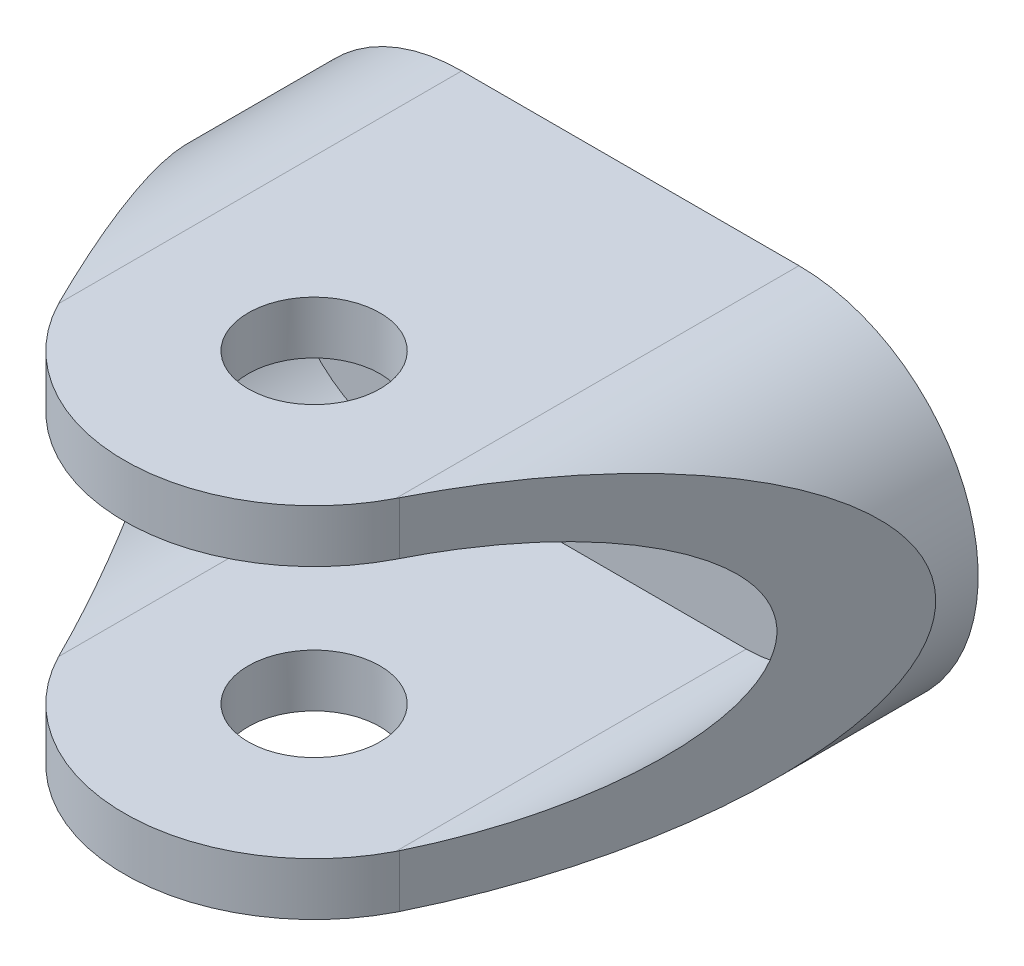
ISO-10303-21;
HEADER;
FILE_DESCRIPTION(('STEP AP214'),'2;1');
FILE_NAME('part.step','',(''),(''),'','','');
FILE_SCHEMA(('AUTOMOTIVE_DESIGN { 1 0 10303 214 1 1 1 1 }'));
ENDSEC;
DATA;
#1=APPLICATION_CONTEXT('core data for automotive mechanical design processes');
#2=APPLICATION_PROTOCOL_DEFINITION('international standard','automotive_design',2000,#1);
#3=PRODUCT_CONTEXT('',#1,'mechanical');
#4=PRODUCT('Part','Part','',(#3));
#5=PRODUCT_RELATED_PRODUCT_CATEGORY('part','',(#4));
#6=PRODUCT_DEFINITION_FORMATION('','',#4);
#7=PRODUCT_DEFINITION_CONTEXT('part definition',#1,'design');
#8=PRODUCT_DEFINITION('design','',#6,#7);
#9=PRODUCT_DEFINITION_SHAPE('','',#8);
#10=(LENGTH_UNIT() NAMED_UNIT(*) SI_UNIT(.MILLI.,.METRE.));
#11=(NAMED_UNIT(*) PLANE_ANGLE_UNIT() SI_UNIT($,.RADIAN.));
#12=(NAMED_UNIT(*) SI_UNIT($,.STERADIAN.) SOLID_ANGLE_UNIT());
#13=UNCERTAINTY_MEASURE_WITH_UNIT(LENGTH_MEASURE(1.E-05),#10,'distance_accuracy_value','');
#14=(GEOMETRIC_REPRESENTATION_CONTEXT(3) GLOBAL_UNCERTAINTY_ASSIGNED_CONTEXT((#13)) GLOBAL_UNIT_ASSIGNED_CONTEXT((#10,
#11,#12)) REPRESENTATION_CONTEXT('',''));
#15=CARTESIAN_POINT('',(0.,0.,0.));
#16=DIRECTION('',(0.,0.,1.));
#17=DIRECTION('',(1.,0.,0.));
#18=AXIS2_PLACEMENT_3D('',#15,#16,#17);
#19=CARTESIAN_POINT('',(0.,21.59,0.));
#20=DIRECTION('',(0.,-1.,0.));
#21=DIRECTION('',(0.,0.,-1.));
#22=AXIS2_PLACEMENT_3D('',#19,#20,#21);
#23=PLANE('',#22);
#24=CARTESIAN_POINT('',(0.,21.59,3.175));
#25=DIRECTION('',(0.,1.,0.));
#26=DIRECTION('',(0.,0.,1.));
#27=AXIS2_PLACEMENT_3D('',#24,#25,#26);
#28=CIRCLE('',#27,3.96875);
#29=CARTESIAN_POINT('',(0.,21.59,7.14375));
#30=VERTEX_POINT('',#29);
#31=EDGE_CURVE('E324',#30,#30,#28,.T.);
#32=ORIENTED_EDGE('',*,*,#31,.F.);
#33=EDGE_LOOP('',(#32));
#34=FACE_BOUND('',#33,.T.);
#35=DIRECTION('',(0.,0.,1.));
#36=VECTOR('',#35,1.);
#37=CARTESIAN_POINT('',(10.16,21.59,-15.875));
#38=LINE('',#37,#36);
#39=CARTESIAN_POINT('',(10.16,21.59,-15.875));
#40=VERTEX_POINT('',#39);
#41=CARTESIAN_POINT('',(10.16,21.59,8.41134414453441));
#42=VERTEX_POINT('',#41);
#43=EDGE_CURVE('E169',#40,#42,#38,.T.);
#44=ORIENTED_EDGE('',*,*,#43,.F.);
#45=DIRECTION('',(-1.,0.,0.));
#46=VECTOR('',#45,1.);
#47=CARTESIAN_POINT('',(-22.225,21.59,-15.875));
#48=LINE('',#47,#46);
#49=CARTESIAN_POINT('',(-10.16,21.59,-15.875));
#50=VERTEX_POINT('',#49);
#51=EDGE_CURVE('E176',#40,#50,#48,.T.);
#52=ORIENTED_EDGE('',*,*,#51,.T.);
#53=DIRECTION('',(0.,0.,1.));
#54=VECTOR('',#53,1.);
#55=CARTESIAN_POINT('',(-10.16,21.59,-15.875));
#56=LINE('',#55,#54);
#57=CARTESIAN_POINT('',(-10.16,21.59,8.41134414453441));
#58=VERTEX_POINT('',#57);
#59=EDGE_CURVE('E373',#50,#58,#56,.T.);
#60=ORIENTED_EDGE('',*,*,#59,.T.);
#61=CARTESIAN_POINT('',(0.,21.59,3.175));
#62=DIRECTION('',(0.,1.,0.));
#63=DIRECTION('',(0.,0.,1.));
#64=AXIS2_PLACEMENT_3D('',#61,#62,#63);
#65=CIRCLE('',#64,11.43);
#66=EDGE_CURVE('E329',#42,#58,#65,.F.);
#67=ORIENTED_EDGE('',*,*,#66,.F.);
#68=EDGE_LOOP('',(#44,#52,#60,#67));
#69=FACE_BOUND('',#68,.T.);
#70=ADVANCED_FACE('F70',(#34,#69),#23,.F.);
#71=CARTESIAN_POINT('',(0.,0.,0.));
#72=DIRECTION('',(0.,-1.,0.));
#73=DIRECTION('',(0.,0.,-1.));
#74=AXIS2_PLACEMENT_3D('',#71,#72,#73);
#75=PLANE('',#74);
#76=CARTESIAN_POINT('',(0.,0.,3.175));
#77=DIRECTION('',(0.,1.,0.));
#78=DIRECTION('',(0.,0.,1.));
#79=AXIS2_PLACEMENT_3D('',#76,#77,#78);
#80=CIRCLE('',#79,3.96875);
#81=CARTESIAN_POINT('',(0.,0.,7.14375));
#82=VERTEX_POINT('',#81);
#83=EDGE_CURVE('E325',#82,#82,#80,.T.);
#84=ORIENTED_EDGE('',*,*,#83,.T.);
#85=EDGE_LOOP('',(#84));
#86=FACE_BOUND('',#85,.T.);
#87=DIRECTION('',(-1.,0.,0.));
#88=VECTOR('',#87,1.);
#89=CARTESIAN_POINT('',(-22.225,0.,-15.875));
#90=LINE('',#89,#88);
#91=CARTESIAN_POINT('',(10.16,0.,-15.875));
#92=VERTEX_POINT('',#91);
#93=CARTESIAN_POINT('',(-10.16,0.,-15.875));
#94=VERTEX_POINT('',#93);
#95=EDGE_CURVE('E174',#92,#94,#90,.T.);
#96=ORIENTED_EDGE('',*,*,#95,.F.);
#97=DIRECTION('',(0.,0.,1.));
#98=VECTOR('',#97,1.);
#99=CARTESIAN_POINT('',(10.16,0.,-15.875));
#100=LINE('',#99,#98);
#101=CARTESIAN_POINT('',(10.16,0.,8.41134414453441));
#102=VERTEX_POINT('',#101);
#103=EDGE_CURVE('E158',#92,#102,#100,.T.);
#104=ORIENTED_EDGE('',*,*,#103,.T.);
#105=CARTESIAN_POINT('',(0.,0.,3.175));
#106=DIRECTION('',(0.,1.,0.));
#107=DIRECTION('',(0.,0.,1.));
#108=AXIS2_PLACEMENT_3D('',#105,#106,#107);
#109=CIRCLE('',#108,11.43);
#110=CARTESIAN_POINT('',(-10.16,0.,8.41134414453441));
#111=VERTEX_POINT('',#110);
#112=EDGE_CURVE('E333',#102,#111,#109,.F.);
#113=ORIENTED_EDGE('',*,*,#112,.T.);
#114=DIRECTION('',(0.,0.,1.));
#115=VECTOR('',#114,1.);
#116=CARTESIAN_POINT('',(-10.16,0.,-15.875));
#117=LINE('',#116,#115);
#118=EDGE_CURVE('E182',#94,#111,#117,.T.);
#119=ORIENTED_EDGE('',*,*,#118,.F.);
#120=EDGE_LOOP('',(#96,#104,#113,#119));
#121=FACE_BOUND('',#120,.T.);
#122=ADVANCED_FACE('F181',(#86,#121),#75,.T.);
#123=CARTESIAN_POINT('',(0.,0.,3.175));
#124=DIRECTION('',(0.,1.,0.));
#125=DIRECTION('',(0.,0.,1.));
#126=AXIS2_PLACEMENT_3D('',#123,#124,#125);
#127=CYLINDRICAL_SURFACE('',#126,11.43);
#128=CARTESIAN_POINT('',(10.16,21.59,8.41134414453441));
#129=CARTESIAN_POINT('',(10.1729685114421,21.589999331326,8.38618152880856));
#130=CARTESIAN_POINT('',(10.1858431777622,21.589976298779,8.36097146571114));
#131=CARTESIAN_POINT('',(10.2114048201584,21.5898855059389,8.31045644477312));
#132=CARTESIAN_POINT('',(10.2240917962346,21.5898177456459,8.28515148693252));
#133=CARTESIAN_POINT('',(10.2366849271889,21.5897276214799,8.25979908172035));
#134=B_SPLINE_CURVE_WITH_KNOTS('',3,(#128,#129,#130,#131,#132,#133),.UNSPECIFIED.,.F.,.F.,(4,2,
4),(0.,0.0849219853898405,0.169843970779766),.UNSPECIFIED.);
#135=CARTESIAN_POINT('',(10.2366849271889,21.5897276214799,8.25979908172035));
#136=VERTEX_POINT('',#135);
#137=EDGE_CURVE('E86',#42,#136,#134,.T.);
#138=ORIENTED_EDGE('',*,*,#137,.F.);
#139=ORIENTED_EDGE('',*,*,#66,.T.);
#140=CARTESIAN_POINT('',(-10.16,21.59,8.41134414453441));
#141=CARTESIAN_POINT('',(-10.1729685114421,21.589999331326,8.38618152880856));
#142=CARTESIAN_POINT('',(-10.1858431777622,21.589976298779,8.36097146571114));
#143=CARTESIAN_POINT('',(-10.2114048201584,21.5898855059389,8.31045644477312));
#144=CARTESIAN_POINT('',(-10.2240917962346,21.5898177456459,8.28515148693252));
#145=CARTESIAN_POINT('',(-10.2366849271889,21.5897276214799,8.25979908172035));
#146=B_SPLINE_CURVE_WITH_KNOTS('',3,(#140,#141,#142,#143,#144,#145),.UNSPECIFIED.,.F.,.F.,(4,2,
4),(0.,0.084921985389839,0.169843970779764),.UNSPECIFIED.);
#147=CARTESIAN_POINT('',(-10.2366849271889,21.5897276214799,8.25979908172035));
#148=VERTEX_POINT('',#147);
#149=EDGE_CURVE('E276',#58,#148,#146,.T.);
#150=ORIENTED_EDGE('',*,*,#149,.T.);
#151=DIRECTION('',(0.,1.,0.));
#152=VECTOR('',#151,1.);
#153=CARTESIAN_POINT('',(-10.2366849271889,0.,8.25979908172035));
#154=LINE('',#153,#152);
#155=CARTESIAN_POINT('',(-10.2366849271889,18.4146141255277,8.25979908172035));
#156=VERTEX_POINT('',#155);
#157=EDGE_CURVE('E190',#156,#148,#154,.T.);
#158=ORIENTED_EDGE('',*,*,#157,.F.);
#159=CARTESIAN_POINT('',(-10.2366849271889,18.4146141255277,8.25979908172035));
#160=CARTESIAN_POINT('',(-10.2240918288484,18.414741803505,8.28515142248112));
#161=CARTESIAN_POINT('',(-10.2114048690791,18.4148377986997,8.31045634809602));
#162=CARTESIAN_POINT('',(-10.1858432266828,18.4149664235238,8.36097136903404));
#163=CARTESIAN_POINT('',(-10.1729685440558,18.4149990531532,8.38618146435716));
#164=CARTESIAN_POINT('',(-10.16,18.415,8.41134414453441));
#165=B_SPLINE_CURVE_WITH_KNOTS('',3,(#159,#160,#161,#162,#163,#164),.UNSPECIFIED.,.F.,.F.,(4,2,
4),(0.,0.0849221220458776,0.169844244091586),.UNSPECIFIED.);
#166=CARTESIAN_POINT('',(-10.16,18.415,8.41134414453441));
#167=VERTEX_POINT('',#166);
#168=EDGE_CURVE('E214',#156,#167,#165,.T.);
#169=ORIENTED_EDGE('',*,*,#168,.T.);
#170=CARTESIAN_POINT('',(0.,18.415,3.175));
#171=DIRECTION('',(0.,-1.,0.));
#172=DIRECTION('',(0.,0.,-1.));
#173=AXIS2_PLACEMENT_3D('',#170,#171,#172);
#174=CIRCLE('',#173,11.43);
#175=CARTESIAN_POINT('',(10.16,18.415,8.41134414453441));
#176=VERTEX_POINT('',#175);
#177=EDGE_CURVE('E204',#176,#167,#174,.T.);
#178=ORIENTED_EDGE('',*,*,#177,.F.);
#179=CARTESIAN_POINT('',(10.2366849271889,18.4146141255277,8.25979908172035));
#180=CARTESIAN_POINT('',(10.2240918288484,18.414741803505,8.28515142248112));
#181=CARTESIAN_POINT('',(10.211404869079,18.4148377986997,8.31045634809602));
#182=CARTESIAN_POINT('',(10.1858432266828,18.4149664235238,8.36097136903404));
#183=CARTESIAN_POINT('',(10.1729685440558,18.4149990531532,8.38618146435716));
#184=CARTESIAN_POINT('',(10.16,18.415,8.41134414453441));
#185=B_SPLINE_CURVE_WITH_KNOTS('',3,(#179,#180,#181,#182,#183,#184),.UNSPECIFIED.,.F.,.F.,(4,2,
4),(0.,0.0849221220458784,0.169844244091583),.UNSPECIFIED.);
#186=CARTESIAN_POINT('',(10.2366849271889,18.4146141255277,8.25979908172035));
#187=VERTEX_POINT('',#186);
#188=EDGE_CURVE('E235',#187,#176,#185,.T.);
#189=ORIENTED_EDGE('',*,*,#188,.F.);
#190=DIRECTION('',(0.,1.,0.));
#191=VECTOR('',#190,1.);
#192=CARTESIAN_POINT('',(10.2366849271889,0.,8.25979908172035));
#193=LINE('',#192,#191);
#194=EDGE_CURVE('E336',#187,#136,#193,.T.);
#195=ORIENTED_EDGE('',*,*,#194,.T.);
#196=EDGE_LOOP('',(#138,#139,#150,#158,#169,#178,#189,#195));
#197=FACE_BOUND('',#196,.T.);
#198=ADVANCED_FACE('F221',(#197),#127,.T.);
#199=CARTESIAN_POINT('',(10.2366849271889,0.000272378520056391,8.25979908172035));
#200=CARTESIAN_POINT('',(10.2240917962346,0.000182254354057978,8.28515148693252));
#201=CARTESIAN_POINT('',(10.2114048201584,0.00011449406105406,8.31045644477312));
#202=CARTESIAN_POINT('',(10.1858431777622,2.37012210352571E-05,8.36097146571114));
#203=CARTESIAN_POINT('',(10.1729685114421,6.68674020328084E-07,8.38618152880857));
#204=CARTESIAN_POINT('',(10.16,0.,8.41134414453441));
#205=B_SPLINE_CURVE_WITH_KNOTS('',3,(#199,#200,#201,#202,#203,#204),.UNSPECIFIED.,.F.,.F.,(4,2,
4),(0.,0.0849219853899263,0.169843970779768),.UNSPECIFIED.);
#206=CARTESIAN_POINT('',(10.2366849271889,0.000272378520051186,8.25979908172035));
#207=VERTEX_POINT('',#206);
#208=EDGE_CURVE('E164',#207,#102,#205,.T.);
#209=ORIENTED_EDGE('',*,*,#208,.F.);
#210=CARTESIAN_POINT('',(10.2366849271889,3.17538587447225,8.25979908172035));
#211=VERTEX_POINT('',#210);
#212=EDGE_CURVE('E338',#207,#211,#193,.T.);
#213=ORIENTED_EDGE('',*,*,#212,.T.);
#214=CARTESIAN_POINT('',(10.16,3.175,8.41134414453441));
#215=CARTESIAN_POINT('',(10.1729685440558,3.17500094684679,8.38618146435716));
#216=CARTESIAN_POINT('',(10.1858432266828,3.17503357647621,8.36097136903405));
#217=CARTESIAN_POINT('',(10.2114048690791,3.17516220130029,8.31045634809602));
#218=CARTESIAN_POINT('',(10.2240918288484,3.17525819649496,8.28515142248112));
#219=CARTESIAN_POINT('',(10.2366849271889,3.17538587447225,8.25979908172035));
#220=B_SPLINE_CURVE_WITH_KNOTS('',3,(#214,#215,#216,#217,#218,#219),.UNSPECIFIED.,.F.,.F.,(4,2,
4),(0.,0.084922122045708,0.169844244091587),.UNSPECIFIED.);
#221=CARTESIAN_POINT('',(10.16,3.175,8.41134414453441));
#222=VERTEX_POINT('',#221);
#223=EDGE_CURVE('E188',#222,#211,#220,.T.);
#224=ORIENTED_EDGE('',*,*,#223,.F.);
#225=CARTESIAN_POINT('',(0.,3.175,3.175));
#226=DIRECTION('',(0.,-1.,0.));
#227=DIRECTION('',(0.,0.,-1.));
#228=AXIS2_PLACEMENT_3D('',#225,#226,#227);
#229=CIRCLE('',#228,11.43);
#230=CARTESIAN_POINT('',(-10.16,3.175,8.41134414453441));
#231=VERTEX_POINT('',#230);
#232=EDGE_CURVE('E198',#222,#231,#229,.T.);
#233=ORIENTED_EDGE('',*,*,#232,.T.);
#234=CARTESIAN_POINT('',(-10.16,3.175,8.41134414453441));
#235=CARTESIAN_POINT('',(-10.1729685440558,3.17500094684679,8.38618146435716));
#236=CARTESIAN_POINT('',(-10.1858432266828,3.17503357647621,8.36097136903404));
#237=CARTESIAN_POINT('',(-10.2114048690791,3.17516220130029,8.31045634809602));
#238=CARTESIAN_POINT('',(-10.2240918288484,3.17525819649496,8.28515142248112));
#239=CARTESIAN_POINT('',(-10.2366849271889,3.17538587447225,8.25979908172035));
#240=B_SPLINE_CURVE_WITH_KNOTS('',3,(#234,#235,#236,#237,#238,#239),.UNSPECIFIED.,.F.,.F.,(4,2,
4),(0.,0.0849221220457041,0.169844244091581),.UNSPECIFIED.);
#241=CARTESIAN_POINT('',(-10.2366849271889,3.17538587447225,8.25979908172035));
#242=VERTEX_POINT('',#241);
#243=EDGE_CURVE('E242',#231,#242,#240,.T.);
#244=ORIENTED_EDGE('',*,*,#243,.T.);
#245=CARTESIAN_POINT('',(-10.2366849271889,0.000272378520051186,8.25979908172035));
#246=VERTEX_POINT('',#245);
#247=EDGE_CURVE('E184',#246,#242,#154,.T.);
#248=ORIENTED_EDGE('',*,*,#247,.F.);
#249=CARTESIAN_POINT('',(-10.2366849271889,0.000272378520056391,8.25979908172035));
#250=CARTESIAN_POINT('',(-10.2240917962346,0.000182254354057984,8.28515148693252));
#251=CARTESIAN_POINT('',(-10.2114048201584,0.00011449406105407,8.31045644477312));
#252=CARTESIAN_POINT('',(-10.1858431777622,2.37012210352741E-05,8.36097146571114));
#253=CARTESIAN_POINT('',(-10.1729685114421,6.68674020345724E-07,8.38618152880856));
#254=CARTESIAN_POINT('',(-10.16,0.,8.41134414453441));
#255=B_SPLINE_CURVE_WITH_KNOTS('',3,(#249,#250,#251,#252,#253,#254),.UNSPECIFIED.,.F.,.F.,(4,2,
4),(0.,0.0849219853899256,0.169843970779764),.UNSPECIFIED.);
#256=EDGE_CURVE('E93',#246,#111,#255,.T.);
#257=ORIENTED_EDGE('',*,*,#256,.T.);
#258=ORIENTED_EDGE('',*,*,#112,.F.);
#259=EDGE_LOOP('',(#209,#213,#224,#233,#244,#248,#257,#258));
#260=FACE_BOUND('',#259,.T.);
#261=ADVANCED_FACE('F354',(#260),#127,.T.);
#262=CARTESIAN_POINT('',(-22.225,21.59,-15.875));
#263=DIRECTION('',(0.,0.,1.));
#264=DIRECTION('',(1.,0.,0.));
#265=AXIS2_PLACEMENT_3D('',#262,#263,#264);
#266=PLANE('',#265);
#267=CARTESIAN_POINT('',(12.7,10.795,-15.875));
#268=DIRECTION('',(0.,0.,1.));
#269=DIRECTION('',(1.,0.,0.));
#270=AXIS2_PLACEMENT_3D('',#267,#268,#269);
#271=CIRCLE('',#270,3.175);
#272=CARTESIAN_POINT('',(15.875,10.795,-15.875));
#273=VERTEX_POINT('',#272);
#274=EDGE_CURVE('E178',#273,#273,#271,.T.);
#275=ORIENTED_EDGE('',*,*,#274,.T.);
#276=EDGE_LOOP('',(#275));
#277=FACE_BOUND('',#276,.T.);
#278=CARTESIAN_POINT('',(-12.7,10.795,-15.875));
#279=DIRECTION('',(0.,0.,1.));
#280=DIRECTION('',(-1.,0.,0.));
#281=AXIS2_PLACEMENT_3D('',#278,#279,#280);
#282=CIRCLE('',#281,3.175);
#283=CARTESIAN_POINT('',(-15.875,10.795,-15.875));
#284=VERTEX_POINT('',#283);
#285=EDGE_CURVE('E428',#284,#284,#282,.T.);
#286=ORIENTED_EDGE('',*,*,#285,.T.);
#287=EDGE_LOOP('',(#286));
#288=FACE_BOUND('',#287,.T.);
#289=CARTESIAN_POINT('',(10.16,10.795,-15.875));
#290=DIRECTION('',(0.,0.,1.));
#291=DIRECTION('',(-1.,0.,0.));
#292=AXIS2_PLACEMENT_3D('',#289,#290,#291);
#293=CIRCLE('',#292,10.795);
#294=EDGE_CURVE('E161',#92,#40,#293,.T.);
#295=ORIENTED_EDGE('',*,*,#294,.F.);
#296=ORIENTED_EDGE('',*,*,#95,.T.);
#297=CARTESIAN_POINT('',(-10.16,10.795,-15.875));
#298=DIRECTION('',(0.,0.,-1.));
#299=DIRECTION('',(1.,0.,0.));
#300=AXIS2_PLACEMENT_3D('',#297,#298,#299);
#301=CIRCLE('',#300,10.795);
#302=EDGE_CURVE('E359',#94,#50,#301,.T.);
#303=ORIENTED_EDGE('',*,*,#302,.T.);
#304=ORIENTED_EDGE('',*,*,#51,.F.);
#305=EDGE_LOOP('',(#295,#296,#303,#304));
#306=FACE_BOUND('',#305,.T.);
#307=ADVANCED_FACE('F72',(#277,#288,#306),#266,.F.);
#308=CARTESIAN_POINT('',(11.5016670919996,0.,5.71314509371278));
#309=DIRECTION('',(0.895597981381353,0.,0.44486431161158));
#310=DIRECTION('',(0.44486431161158,0.,-0.895597981381354));
#311=AXIS2_PLACEMENT_3D('',#308,#309,#310);
#312=PLANE('',#311);
#313=ORIENTED_EDGE('',*,*,#212,.F.);
#314=CARTESIAN_POINT('',(10.16,10.795,8.41418068572883));
#315=DIRECTION('',(0.895597981381353,0.,0.44486431161158));
#316=DIRECTION('',(-0.44486431161158,0.,0.895597981381354));
#317=AXIS2_PLACEMENT_3D('',#314,#315,#316);
#318=ELLIPSE('',#317,24.2658260468089,10.795);
#319=EDGE_CURVE('E13',#207,#136,#318,.T.);
#320=ORIENTED_EDGE('',*,*,#319,.T.);
#321=ORIENTED_EDGE('',*,*,#194,.F.);
#322=CARTESIAN_POINT('',(10.16,10.795,8.41418068572883));
#323=DIRECTION('',(0.895597981381353,0.,0.44486431161158));
#324=DIRECTION('',(-0.44486431161158,0.,0.895597981381354));
#325=AXIS2_PLACEMENT_3D('',#322,#323,#324);
#326=ELLIPSE('',#325,17.1288183859828,7.62);
#327=EDGE_CURVE('E316',#187,#211,#326,.F.);
#328=ORIENTED_EDGE('',*,*,#327,.T.);
#329=EDGE_LOOP('',(#313,#320,#321,#328));
#330=FACE_BOUND('',#329,.T.);
#331=ADVANCED_FACE('F353',(#330),#312,.T.);
#332=CARTESIAN_POINT('',(0.,0.,3.175));
#333=DIRECTION('',(0.,1.,0.));
#334=DIRECTION('',(0.,0.,1.));
#335=AXIS2_PLACEMENT_3D('',#332,#333,#334);
#336=CYLINDRICAL_SURFACE('',#335,3.96875);
#337=ORIENTED_EDGE('',*,*,#31,.T.);
#338=EDGE_LOOP('',(#337));
#339=FACE_BOUND('',#338,.T.);
#340=CARTESIAN_POINT('',(0.,18.415,3.175));
#341=DIRECTION('',(0.,-1.,0.));
#342=DIRECTION('',(0.,0.,-1.));
#343=AXIS2_PLACEMENT_3D('',#340,#341,#342);
#344=CIRCLE('',#343,3.96875);
#345=CARTESIAN_POINT('',(0.,18.415,-0.793750000000003));
#346=VERTEX_POINT('',#345);
#347=EDGE_CURVE('E200',#346,#346,#344,.F.);
#348=ORIENTED_EDGE('',*,*,#347,.F.);
#349=EDGE_LOOP('',(#348));
#350=FACE_BOUND('',#349,.T.);
#351=ADVANCED_FACE('F412',(#339,#350),#336,.F.);
#352=CARTESIAN_POINT('',(-11.5016670919996,0.,5.71314509371278));
#353=DIRECTION('',(0.895597981381353,0.,-0.44486431161158));
#354=DIRECTION('',(-0.44486431161158,0.,-0.895597981381354));
#355=AXIS2_PLACEMENT_3D('',#352,#353,#354);
#356=PLANE('',#355);
#357=ORIENTED_EDGE('',*,*,#157,.T.);
#358=CARTESIAN_POINT('',(-10.16,10.795,8.41418068572883));
#359=DIRECTION('',(0.895597981381353,0.,-0.44486431161158));
#360=DIRECTION('',(0.44486431161158,0.,0.895597981381354));
#361=AXIS2_PLACEMENT_3D('',#358,#359,#360);
#362=ELLIPSE('',#361,24.2658260468089,10.795);
#363=EDGE_CURVE('E79',#148,#246,#362,.F.);
#364=ORIENTED_EDGE('',*,*,#363,.T.);
#365=ORIENTED_EDGE('',*,*,#247,.T.);
#366=CARTESIAN_POINT('',(-10.16,10.795,8.41418068572883));
#367=DIRECTION('',(0.895597981381353,0.,-0.44486431161158));
#368=DIRECTION('',(0.44486431161158,0.,0.895597981381354));
#369=AXIS2_PLACEMENT_3D('',#366,#367,#368);
#370=ELLIPSE('',#369,17.1288183859828,7.62);
#371=EDGE_CURVE('E320',#242,#156,#370,.T.);
#372=ORIENTED_EDGE('',*,*,#371,.T.);
#373=EDGE_LOOP('',(#357,#364,#365,#372));
#374=FACE_BOUND('',#373,.T.);
#375=ADVANCED_FACE('F383',(#374),#356,.F.);
#376=CARTESIAN_POINT('',(0.,3.175,3.175));
#377=DIRECTION('',(0.,-1.,0.));
#378=DIRECTION('',(0.,0.,-1.));
#379=AXIS2_PLACEMENT_3D('',#376,#377,#378);
#380=CIRCLE('',#379,3.96875);
#381=CARTESIAN_POINT('',(0.,3.175,-0.793750000000003));
#382=VERTEX_POINT('',#381);
#383=EDGE_CURVE('E194',#382,#382,#380,.F.);
#384=ORIENTED_EDGE('',*,*,#383,.T.);
#385=EDGE_LOOP('',(#384));
#386=FACE_BOUND('',#385,.T.);
#387=ORIENTED_EDGE('',*,*,#83,.F.);
#388=EDGE_LOOP('',(#387));
#389=FACE_BOUND('',#388,.T.);
#390=ADVANCED_FACE('F233',(#386,#389),#336,.F.);
#391=CARTESIAN_POINT('',(-10.16,10.795,-54.5631273777887));
#392=DIRECTION('',(0.,0.,1.));
#393=DIRECTION('',(1.,0.,0.));
#394=AXIS2_PLACEMENT_3D('',#391,#392,#393);
#395=CYLINDRICAL_SURFACE('',#394,7.62);
#396=ORIENTED_EDGE('',*,*,#371,.F.);
#397=ORIENTED_EDGE('',*,*,#243,.F.);
#398=DIRECTION('',(0.,0.,1.));
#399=VECTOR('',#398,1.);
#400=CARTESIAN_POINT('',(-10.16,3.175,-54.5631273777887));
#401=LINE('',#400,#399);
#402=CARTESIAN_POINT('',(-10.16,3.175,-12.7));
#403=VERTEX_POINT('',#402);
#404=EDGE_CURVE('E298',#403,#231,#401,.T.);
#405=ORIENTED_EDGE('',*,*,#404,.F.);
#406=CARTESIAN_POINT('',(-10.16,10.795,-12.7));
#407=DIRECTION('',(0.,0.,1.));
#408=DIRECTION('',(1.,0.,0.));
#409=AXIS2_PLACEMENT_3D('',#406,#407,#408);
#410=CIRCLE('',#409,7.62);
#411=CARTESIAN_POINT('',(-10.16,18.415,-12.7));
#412=VERTEX_POINT('',#411);
#413=EDGE_CURVE('E285',#403,#412,#410,.F.);
#414=ORIENTED_EDGE('',*,*,#413,.T.);
#415=DIRECTION('',(0.,0.,1.));
#416=VECTOR('',#415,1.);
#417=CARTESIAN_POINT('',(-10.16,18.415,-54.5631273777887));
#418=LINE('',#417,#416);
#419=EDGE_CURVE('E302',#412,#167,#418,.T.);
#420=ORIENTED_EDGE('',*,*,#419,.T.);
#421=ORIENTED_EDGE('',*,*,#168,.F.);
#422=EDGE_LOOP('',(#396,#397,#405,#414,#420,#421));
#423=FACE_BOUND('',#422,.T.);
#424=ADVANCED_FACE('F231',(#423),#395,.F.);
#425=CARTESIAN_POINT('',(10.16,10.795,-54.5631273777887));
#426=DIRECTION('',(0.,0.,1.));
#427=DIRECTION('',(1.,0.,0.));
#428=AXIS2_PLACEMENT_3D('',#425,#426,#427);
#429=CYLINDRICAL_SURFACE('',#428,7.62);
#430=ORIENTED_EDGE('',*,*,#188,.T.);
#431=DIRECTION('',(0.,0.,1.));
#432=VECTOR('',#431,1.);
#433=CARTESIAN_POINT('',(10.16,18.415,-54.5631273777887));
#434=LINE('',#433,#432);
#435=CARTESIAN_POINT('',(10.16,18.415,-12.7));
#436=VERTEX_POINT('',#435);
#437=EDGE_CURVE('E284',#436,#176,#434,.T.);
#438=ORIENTED_EDGE('',*,*,#437,.F.);
#439=CARTESIAN_POINT('',(10.16,10.795,-12.7));
#440=DIRECTION('',(0.,0.,1.));
#441=DIRECTION('',(1.,0.,0.));
#442=AXIS2_PLACEMENT_3D('',#439,#440,#441);
#443=CIRCLE('',#442,7.62);
#444=CARTESIAN_POINT('',(10.16,3.175,-12.7));
#445=VERTEX_POINT('',#444);
#446=EDGE_CURVE('E199',#445,#436,#443,.T.);
#447=ORIENTED_EDGE('',*,*,#446,.F.);
#448=DIRECTION('',(0.,0.,1.));
#449=VECTOR('',#448,1.);
#450=CARTESIAN_POINT('',(10.16,3.175,-54.5631273777887));
#451=LINE('',#450,#449);
#452=EDGE_CURVE('E295',#445,#222,#451,.T.);
#453=ORIENTED_EDGE('',*,*,#452,.T.);
#454=ORIENTED_EDGE('',*,*,#223,.T.);
#455=ORIENTED_EDGE('',*,*,#327,.F.);
#456=EDGE_LOOP('',(#430,#438,#447,#453,#454,#455));
#457=FACE_BOUND('',#456,.T.);
#458=ADVANCED_FACE('F225',(#457),#429,.F.);
#459=CARTESIAN_POINT('',(0.,18.415,-54.5631273777887));
#460=DIRECTION('',(0.,-1.,0.));
#461=DIRECTION('',(0.,0.,-1.));
#462=AXIS2_PLACEMENT_3D('',#459,#460,#461);
#463=PLANE('',#462);
#464=ORIENTED_EDGE('',*,*,#347,.T.);
#465=EDGE_LOOP('',(#464));
#466=FACE_BOUND('',#465,.T.);
#467=ORIENTED_EDGE('',*,*,#177,.T.);
#468=ORIENTED_EDGE('',*,*,#419,.F.);
#469=DIRECTION('',(-1.,0.,0.));
#470=VECTOR('',#469,1.);
#471=CARTESIAN_POINT('',(0.,18.415,-12.7));
#472=LINE('',#471,#470);
#473=EDGE_CURVE('E289',#436,#412,#472,.T.);
#474=ORIENTED_EDGE('',*,*,#473,.F.);
#475=ORIENTED_EDGE('',*,*,#437,.T.);
#476=EDGE_LOOP('',(#467,#468,#474,#475));
#477=FACE_BOUND('',#476,.T.);
#478=ADVANCED_FACE('F230',(#466,#477),#463,.T.);
#479=CARTESIAN_POINT('',(0.,3.175,-54.5631273777887));
#480=DIRECTION('',(0.,-1.,0.));
#481=DIRECTION('',(0.,0.,-1.));
#482=AXIS2_PLACEMENT_3D('',#479,#480,#481);
#483=PLANE('',#482);
#484=ORIENTED_EDGE('',*,*,#383,.F.);
#485=EDGE_LOOP('',(#484));
#486=FACE_BOUND('',#485,.T.);
#487=ORIENTED_EDGE('',*,*,#452,.F.);
#488=DIRECTION('',(-1.,0.,0.));
#489=VECTOR('',#488,1.);
#490=CARTESIAN_POINT('',(0.,3.175,-12.7));
#491=LINE('',#490,#489);
#492=EDGE_CURVE('E288',#445,#403,#491,.T.);
#493=ORIENTED_EDGE('',*,*,#492,.T.);
#494=ORIENTED_EDGE('',*,*,#404,.T.);
#495=ORIENTED_EDGE('',*,*,#232,.F.);
#496=EDGE_LOOP('',(#487,#493,#494,#495));
#497=FACE_BOUND('',#496,.T.);
#498=ADVANCED_FACE('F253',(#486,#497),#483,.F.);
#499=CARTESIAN_POINT('',(-22.225,21.59,-12.7));
#500=DIRECTION('',(0.,0.,1.));
#501=DIRECTION('',(1.,0.,0.));
#502=AXIS2_PLACEMENT_3D('',#499,#500,#501);
#503=PLANE('',#502);
#504=CARTESIAN_POINT('',(12.7,10.795,-12.7));
#505=DIRECTION('',(0.,0.,1.));
#506=DIRECTION('',(1.,0.,0.));
#507=AXIS2_PLACEMENT_3D('',#504,#505,#506);
#508=CIRCLE('',#507,3.175);
#509=CARTESIAN_POINT('',(15.875,10.795,-12.7));
#510=VERTEX_POINT('',#509);
#511=EDGE_CURVE('E435',#510,#510,#508,.T.);
#512=ORIENTED_EDGE('',*,*,#511,.F.);
#513=EDGE_LOOP('',(#512));
#514=FACE_BOUND('',#513,.T.);
#515=CARTESIAN_POINT('',(-12.7,10.795,-12.7));
#516=DIRECTION('',(0.,0.,1.));
#517=DIRECTION('',(-1.,0.,0.));
#518=AXIS2_PLACEMENT_3D('',#515,#516,#517);
#519=CIRCLE('',#518,3.175);
#520=CARTESIAN_POINT('',(-15.875,10.795,-12.7));
#521=VERTEX_POINT('',#520);
#522=EDGE_CURVE('E431',#521,#521,#519,.T.);
#523=ORIENTED_EDGE('',*,*,#522,.F.);
#524=EDGE_LOOP('',(#523));
#525=FACE_BOUND('',#524,.T.);
#526=ORIENTED_EDGE('',*,*,#492,.F.);
#527=ORIENTED_EDGE('',*,*,#446,.T.);
#528=ORIENTED_EDGE('',*,*,#473,.T.);
#529=ORIENTED_EDGE('',*,*,#413,.F.);
#530=EDGE_LOOP('',(#526,#527,#528,#529));
#531=FACE_BOUND('',#530,.T.);
#532=ADVANCED_FACE('F257',(#514,#525,#531),#503,.T.);
#533=CARTESIAN_POINT('',(-10.16,10.795,-15.875));
#534=DIRECTION('',(0.,0.,1.));
#535=DIRECTION('',(1.,0.,0.));
#536=AXIS2_PLACEMENT_3D('',#533,#534,#535);
#537=CYLINDRICAL_SURFACE('',#536,10.795);
#538=ORIENTED_EDGE('',*,*,#59,.F.);
#539=ORIENTED_EDGE('',*,*,#302,.F.);
#540=ORIENTED_EDGE('',*,*,#118,.T.);
#541=ORIENTED_EDGE('',*,*,#256,.F.);
#542=ORIENTED_EDGE('',*,*,#363,.F.);
#543=ORIENTED_EDGE('',*,*,#149,.F.);
#544=EDGE_LOOP('',(#538,#539,#540,#541,#542,#543));
#545=FACE_BOUND('',#544,.T.);
#546=ADVANCED_FACE('F261',(#545),#537,.T.);
#547=CARTESIAN_POINT('',(10.16,10.795,-15.875));
#548=DIRECTION('',(0.,0.,1.));
#549=DIRECTION('',(1.,0.,0.));
#550=AXIS2_PLACEMENT_3D('',#547,#548,#549);
#551=CYLINDRICAL_SURFACE('',#550,10.795);
#552=ORIENTED_EDGE('',*,*,#137,.T.);
#553=ORIENTED_EDGE('',*,*,#319,.F.);
#554=ORIENTED_EDGE('',*,*,#208,.T.);
#555=ORIENTED_EDGE('',*,*,#103,.F.);
#556=ORIENTED_EDGE('',*,*,#294,.T.);
#557=ORIENTED_EDGE('',*,*,#43,.T.);
#558=EDGE_LOOP('',(#552,#553,#554,#555,#556,#557));
#559=FACE_BOUND('',#558,.T.);
#560=ADVANCED_FACE('F160',(#559),#551,.T.);
#561=CARTESIAN_POINT('',(-12.7,10.795,-15.875));
#562=DIRECTION('',(0.,0.,1.));
#563=DIRECTION('',(1.,0.,0.));
#564=AXIS2_PLACEMENT_3D('',#561,#562,#563);
#565=CYLINDRICAL_SURFACE('',#564,3.175);
#566=ORIENTED_EDGE('',*,*,#285,.F.);
#567=EDGE_LOOP('',(#566));
#568=FACE_BOUND('',#567,.T.);
#569=ORIENTED_EDGE('',*,*,#522,.T.);
#570=EDGE_LOOP('',(#569));
#571=FACE_BOUND('',#570,.T.);
#572=ADVANCED_FACE('F448',(#568,#571),#565,.F.);
#573=CARTESIAN_POINT('',(12.7,10.795,-15.875));
#574=DIRECTION('',(0.,0.,1.));
#575=DIRECTION('',(1.,0.,0.));
#576=AXIS2_PLACEMENT_3D('',#573,#574,#575);
#577=CYLINDRICAL_SURFACE('',#576,3.175);
#578=ORIENTED_EDGE('',*,*,#274,.F.);
#579=EDGE_LOOP('',(#578));
#580=FACE_BOUND('',#579,.T.);
#581=ORIENTED_EDGE('',*,*,#511,.T.);
#582=EDGE_LOOP('',(#581));
#583=FACE_BOUND('',#582,.T.);
#584=ADVANCED_FACE('F444',(#580,#583),#577,.F.);
#585=CLOSED_SHELL('',(#70,#122,#198,#261,#307,#331,#351,#375,#390,#424,#458,#478,#498,#532,#546,
#560,#572,#584));
#586=MANIFOLD_SOLID_BREP('B2',#585);
#587=ADVANCED_BREP_SHAPE_REPRESENTATION('',(#18,#586),#14);
#588=SHAPE_DEFINITION_REPRESENTATION(#9,#587);
ENDSEC;
END-ISO-10303-21;
